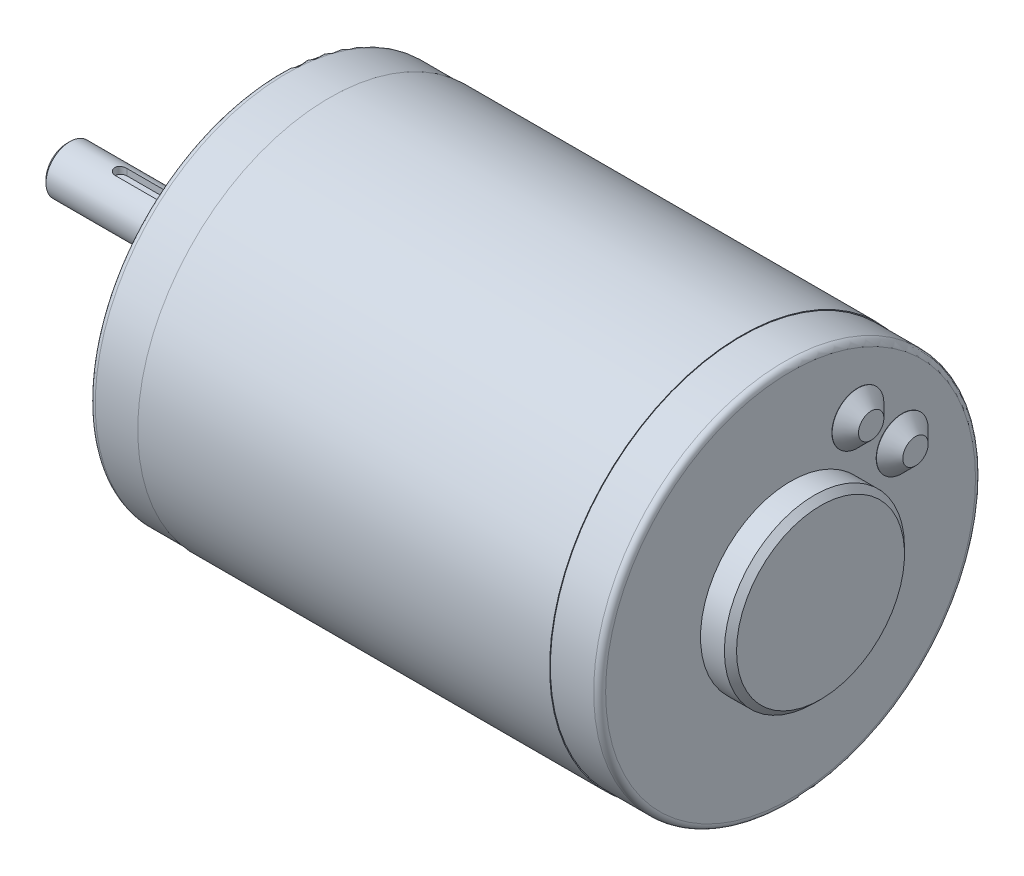
ISO-10303-21;
HEADER;
FILE_DESCRIPTION(('STEP AP214'),'2;1');
FILE_NAME('part.step','',(''),(''),'','','');
FILE_SCHEMA(('AUTOMOTIVE_DESIGN { 1 0 10303 214 1 1 1 1 }'));
ENDSEC;
DATA;
#1=APPLICATION_CONTEXT('core data for automotive mechanical design processes');
#2=APPLICATION_PROTOCOL_DEFINITION('international standard','automotive_design',2000,#1);
#3=PRODUCT_CONTEXT('',#1,'mechanical');
#4=PRODUCT('Part','Part','',(#3));
#5=PRODUCT_RELATED_PRODUCT_CATEGORY('part','',(#4));
#6=PRODUCT_DEFINITION_FORMATION('','',#4);
#7=PRODUCT_DEFINITION_CONTEXT('part definition',#1,'design');
#8=PRODUCT_DEFINITION('design','',#6,#7);
#9=PRODUCT_DEFINITION_SHAPE('','',#8);
#10=(LENGTH_UNIT() NAMED_UNIT(*) SI_UNIT(.MILLI.,.METRE.));
#11=(NAMED_UNIT(*) PLANE_ANGLE_UNIT() SI_UNIT($,.RADIAN.));
#12=(NAMED_UNIT(*) SI_UNIT($,.STERADIAN.) SOLID_ANGLE_UNIT());
#13=UNCERTAINTY_MEASURE_WITH_UNIT(LENGTH_MEASURE(1.E-05),#10,'distance_accuracy_value','');
#14=(GEOMETRIC_REPRESENTATION_CONTEXT(3) GLOBAL_UNCERTAINTY_ASSIGNED_CONTEXT((#13)) GLOBAL_UNIT_ASSIGNED_CONTEXT((#10,
#11,#12)) REPRESENTATION_CONTEXT('',''));
#15=CARTESIAN_POINT('',(0.,0.,0.));
#16=DIRECTION('',(0.,0.,1.));
#17=DIRECTION('',(1.,0.,0.));
#18=AXIS2_PLACEMENT_3D('',#15,#16,#17);
#19=CARTESIAN_POINT('',(-35.6,0.,0.));
#20=DIRECTION('',(-1.,0.,0.));
#21=DIRECTION('',(0.,0.,1.));
#22=AXIS2_PLACEMENT_3D('',#19,#20,#21);
#23=PLANE('',#22);
#24=CARTESIAN_POINT('',(-35.6000000000449,0.,0.));
#25=DIRECTION('',(1.,0.,0.));
#26=DIRECTION('',(0.,0.,-1.));
#27=AXIS2_PLACEMENT_3D('',#24,#25,#26);
#28=CIRCLE('',#27,3.49999999997408);
#29=CARTESIAN_POINT('',(-35.6000000000449,0.,-3.49999999997408));
#30=VERTEX_POINT('',#29);
#31=EDGE_CURVE('E20',#30,#30,#28,.T.);
#32=ORIENTED_EDGE('',*,*,#31,.F.);
#33=EDGE_LOOP('',(#32));
#34=FACE_BOUND('',#33,.T.);
#35=ADVANCED_FACE('F17',(#34),#23,.T.);
#36=CARTESIAN_POINT('',(-27.6,2.79999999999999,-1.));
#37=DIRECTION('',(0.,-1.,0.));
#38=DIRECTION('',(0.,0.,-1.));
#39=AXIS2_PLACEMENT_3D('',#36,#37,#38);
#40=PLANE('',#39);
#41=CARTESIAN_POINT('',(-7.1,2.79999999999999,0.));
#42=DIRECTION('',(0.,1.,0.));
#43=DIRECTION('',(0.,0.,1.));
#44=AXIS2_PLACEMENT_3D('',#41,#42,#43);
#45=CIRCLE('',#44,1.);
#46=CARTESIAN_POINT('',(-7.1,2.79999999999999,1.));
#47=VERTEX_POINT('',#46);
#48=CARTESIAN_POINT('',(-7.1,2.79999999999999,-1.));
#49=VERTEX_POINT('',#48);
#50=EDGE_CURVE('E79',#47,#49,#45,.T.);
#51=ORIENTED_EDGE('',*,*,#50,.T.);
#52=DIRECTION('',(1.,0.,0.));
#53=VECTOR('',#52,1.);
#54=CARTESIAN_POINT('',(-27.6,2.79999999999999,-1.));
#55=LINE('',#54,#53);
#56=CARTESIAN_POINT('',(-26.6,2.79999999999999,-1.));
#57=VERTEX_POINT('',#56);
#58=EDGE_CURVE('E73',#57,#49,#55,.T.);
#59=ORIENTED_EDGE('',*,*,#58,.F.);
#60=CARTESIAN_POINT('',(-26.6,2.79999999999999,0.));
#61=DIRECTION('',(0.,-1.,0.));
#62=DIRECTION('',(0.,0.,-1.));
#63=AXIS2_PLACEMENT_3D('',#60,#61,#62);
#64=CIRCLE('',#63,1.);
#65=CARTESIAN_POINT('',(-26.6,2.79999999999999,1.));
#66=VERTEX_POINT('',#65);
#67=EDGE_CURVE('E76',#57,#66,#64,.F.);
#68=ORIENTED_EDGE('',*,*,#67,.T.);
#69=DIRECTION('',(1.,0.,0.));
#70=VECTOR('',#69,1.);
#71=CARTESIAN_POINT('',(-27.6,2.79999999999999,1.));
#72=LINE('',#71,#70);
#73=EDGE_CURVE('E101',#66,#47,#72,.T.);
#74=ORIENTED_EDGE('',*,*,#73,.T.);
#75=EDGE_LOOP('',(#51,#59,#68,#74));
#76=FACE_BOUND('',#75,.T.);
#77=ADVANCED_FACE('F75',(#76),#40,.F.);
#78=CARTESIAN_POINT('',(-35.1000000000568,0.,0.));
#79=DIRECTION('',(1.,0.,0.));
#80=DIRECTION('',(0.,0.,-1.));
#81=AXIS2_PLACEMENT_3D('',#78,#79,#80);
#82=CONICAL_SURFACE('',#81,4.0000000000191,0.785398163454292);
#83=ORIENTED_EDGE('',*,*,#31,.T.);
#84=EDGE_LOOP('',(#83));
#85=FACE_BOUND('',#84,.T.);
#86=CARTESIAN_POINT('',(-35.1,0.,0.));
#87=DIRECTION('',(1.,0.,0.));
#88=DIRECTION('',(0.,0.,-1.));
#89=AXIS2_PLACEMENT_3D('',#86,#87,#88);
#90=CIRCLE('',#89,4.);
#91=CARTESIAN_POINT('',(-35.1,0.,-4.));
#92=VERTEX_POINT('',#91);
#93=EDGE_CURVE('E339',#92,#92,#90,.T.);
#94=ORIENTED_EDGE('',*,*,#93,.F.);
#95=EDGE_LOOP('',(#94));
#96=FACE_BOUND('',#95,.T.);
#97=ADVANCED_FACE('F572',(#85,#96),#82,.T.);
#98=CARTESIAN_POINT('',(-26.6,3.87298334620741,0.));
#99=DIRECTION('',(0.,-1.,0.));
#100=DIRECTION('',(0.,0.,-1.));
#101=AXIS2_PLACEMENT_3D('',#98,#99,#100);
#102=CYLINDRICAL_SURFACE('',#101,1.);
#103=CARTESIAN_POINT('',(-26.6,3.87298334620742,1.));
#104=CARTESIAN_POINT('',(-26.6276629851065,3.87298148580177,1.00000033749611));
#105=CARTESIAN_POINT('',(-26.6553122630182,3.87328009949471,0.998851407375366));
#106=CARTESIAN_POINT('',(-26.7104040353036,3.87445904774559,0.994271295395754));
#107=CARTESIAN_POINT('',(-26.7378465636871,3.87533928441687,0.990840497572679));
#108=CARTESIAN_POINT('',(-26.8194531732088,3.87881710972054,0.977175239382527));
#109=CARTESIAN_POINT('',(-26.8730564684822,3.88225203148809,0.963567695172493));
#110=CARTESIAN_POINT('',(-26.977124673782,3.89095422588003,0.927798076247996));
#111=CARTESIAN_POINT('',(-27.0275898782129,3.8962213263093,0.905636805423835));
#112=CARTESIAN_POINT('',(-27.1241114486473,3.90799134471939,0.853415378025864));
#113=CARTESIAN_POINT('',(-27.170166627891,3.91449459395647,0.823353103356932));
#114=CARTESIAN_POINT('',(-27.2575438819061,3.92816262398025,0.755484471828068));
#115=CARTESIAN_POINT('',(-27.2987548862455,3.93533791028916,0.717537268783975));
#116=CARTESIAN_POINT('',(-27.3743020894827,3.94945104396194,0.635275780516229));
#117=CARTESIAN_POINT('',(-27.4086371894679,3.95638885322537,0.59096047947883));
#118=CARTESIAN_POINT('',(-27.4699110016186,3.96936182283248,0.496456899401689));
#119=CARTESIAN_POINT('',(-27.496739895984,3.9753830468173,0.446195340334472));
#120=CARTESIAN_POINT('',(-27.5415247341967,3.98572346250589,0.341702590842918));
#121=CARTESIAN_POINT('',(-27.5594824242998,3.99004298914701,0.28747218408301));
#122=CARTESIAN_POINT('',(-27.5856589927774,3.99641900005128,0.17774410852516));
#123=CARTESIAN_POINT('',(-27.5940676724228,3.99851952901301,0.122294322002858));
#124=CARTESIAN_POINT('',(-27.6015033715433,4.00037438150816,0.0107327756816791));
#125=CARTESIAN_POINT('',(-27.6005315701923,4.00012899993445,-0.0453789000287062));
#126=CARTESIAN_POINT('',(-27.5893700363146,3.99735237365736,-0.155352492972097));
#127=CARTESIAN_POINT('',(-27.5793853834005,3.99487198677361,-0.209236701739855));
#128=CARTESIAN_POINT('',(-27.5508113208173,3.98796330636496,-0.31453871108434));
#129=CARTESIAN_POINT('',(-27.5322215304314,3.98353492665556,-0.365956402423988));
#130=CARTESIAN_POINT('',(-27.4867987193294,3.97314997761798,-0.465407286024539));
#131=CARTESIAN_POINT('',(-27.4598926057672,3.96717993827555,-0.513405629602249));
#132=CARTESIAN_POINT('',(-27.3986568701665,3.95435945541919,-0.604276631230015));
#133=CARTESIAN_POINT('',(-27.3643261297468,3.94750887933198,-0.64714851556229));
#134=CARTESIAN_POINT('',(-27.2881210879187,3.93345566022866,-0.727769389708492));
#135=CARTESIAN_POINT('',(-27.2460683634602,3.92624850477686,-0.765349103054128));
#136=CARTESIAN_POINT('',(-27.1561701330723,3.91246168284006,-0.832969575186237));
#137=CARTESIAN_POINT('',(-27.1083230467164,3.90588218842993,-0.863008270245062));
#138=CARTESIAN_POINT('',(-27.0078544021762,3.89407813586325,-0.914804709285961));
#139=CARTESIAN_POINT('',(-26.9552085351039,3.88886106009137,-0.936517017887269));
#140=CARTESIAN_POINT('',(-26.8468830715817,3.88047058807055,-0.970702351849828));
#141=CARTESIAN_POINT('',(-26.7912081448502,3.87729413761435,-0.983189189212131));
#142=CARTESIAN_POINT('',(-26.7125426192411,3.87455290681524,-0.993904635150938));
#143=CARTESIAN_POINT('',(-26.6900802967868,3.8739652311086,-0.996190790966708));
#144=CARTESIAN_POINT('',(-26.6450822100907,3.87318062488975,-0.999236757697393));
#145=CARTESIAN_POINT('',(-26.6225466240447,3.87298306219461,-0.999999038096045));
#146=CARTESIAN_POINT('',(-26.6,3.87298334620742,-1.));
#147=B_SPLINE_CURVE_WITH_KNOTS('',3,(#103,#104,#105,#106,#107,#108,#109,#110,#111,#112,#113,
#114,#115,#116,#117,#118,#119,#120,#121,#122,#123,#124,#125,#126,#127,#128,#129,#130,#131,#132,
#133,#134,#135,#136,#137,#138,#139,#140,#141,#142,#143,#144,#145,#146),.UNSPECIFIED.,.F.,.F.,(4,
2,2,2,2,2,2,2,2,2,2,2,2,2,2,2,2,2,2,2,2,4),(0.,0.0829365303397693,0.16585910608465,
0.331229963080318,0.496585282091499,0.661984974726751,0.830641897427976,0.999325753539196,
1.17036187098235,1.34136430732424,1.50890481515325,1.67642426256639,1.84022545479276,
2.00403389475838,2.16932509450377,2.33464120964329,2.50441429534542,2.67423379180967,
2.84496720161068,3.01544447539986,3.08315848722648,3.15076267731671),.UNSPECIFIED.);
#148=CARTESIAN_POINT('',(-26.6,3.87298334620742,1.));
#149=VERTEX_POINT('',#148);
#150=CARTESIAN_POINT('',(-26.6,3.87298334620742,-1.));
#151=VERTEX_POINT('',#150);
#152=EDGE_CURVE('E158',#149,#151,#147,.T.);
#153=ORIENTED_EDGE('',*,*,#152,.F.);
#154=DIRECTION('',(0.,1.,0.));
#155=VECTOR('',#154,1.);
#156=CARTESIAN_POINT('',(-26.6,2.79999999999999,1.));
#157=LINE('',#156,#155);
#158=EDGE_CURVE('E89',#149,#66,#157,.F.);
#159=ORIENTED_EDGE('',*,*,#158,.T.);
#160=ORIENTED_EDGE('',*,*,#67,.F.);
#161=DIRECTION('',(0.,1.,0.));
#162=VECTOR('',#161,1.);
#163=CARTESIAN_POINT('',(-26.6,2.79999999999999,-1.));
#164=LINE('',#163,#162);
#165=EDGE_CURVE('E83',#151,#57,#164,.F.);
#166=ORIENTED_EDGE('',*,*,#165,.F.);
#167=EDGE_LOOP('',(#153,#159,#160,#166));
#168=FACE_BOUND('',#167,.T.);
#169=ADVANCED_FACE('F86',(#168),#102,.F.);
#170=CARTESIAN_POINT('',(-27.6,2.79999999999999,-1.));
#171=DIRECTION('',(0.,0.,1.));
#172=DIRECTION('',(1.,0.,0.));
#173=AXIS2_PLACEMENT_3D('',#170,#171,#172);
#174=PLANE('',#173);
#175=DIRECTION('',(1.,0.,0.));
#176=VECTOR('',#175,1.);
#177=CARTESIAN_POINT('',(0.,3.87298334620742,-1.));
#178=LINE('',#177,#176);
#179=CARTESIAN_POINT('',(-7.1,3.87298334620742,-1.));
#180=VERTEX_POINT('',#179);
#181=EDGE_CURVE('E93',#151,#180,#178,.T.);
#182=ORIENTED_EDGE('',*,*,#181,.F.);
#183=ORIENTED_EDGE('',*,*,#165,.T.);
#184=ORIENTED_EDGE('',*,*,#58,.T.);
#185=DIRECTION('',(0.,1.,0.));
#186=VECTOR('',#185,1.);
#187=CARTESIAN_POINT('',(-7.1,2.79999999999999,-1.));
#188=LINE('',#187,#186);
#189=EDGE_CURVE('E96',#49,#180,#188,.T.);
#190=ORIENTED_EDGE('',*,*,#189,.T.);
#191=EDGE_LOOP('',(#182,#183,#184,#190));
#192=FACE_BOUND('',#191,.T.);
#193=ADVANCED_FACE('F91',(#192),#174,.T.);
#194=CARTESIAN_POINT('',(-7.1,2.79999999999999,0.));
#195=DIRECTION('',(0.,1.,0.));
#196=DIRECTION('',(0.,0.,1.));
#197=AXIS2_PLACEMENT_3D('',#194,#195,#196);
#198=CYLINDRICAL_SURFACE('',#197,1.);
#199=ORIENTED_EDGE('',*,*,#50,.F.);
#200=DIRECTION('',(0.,1.,0.));
#201=VECTOR('',#200,1.);
#202=CARTESIAN_POINT('',(-7.1,2.79999999999999,1.));
#203=LINE('',#202,#201);
#204=CARTESIAN_POINT('',(-7.1,3.87298334620742,1.));
#205=VERTEX_POINT('',#204);
#206=EDGE_CURVE('E102',#47,#205,#203,.T.);
#207=ORIENTED_EDGE('',*,*,#206,.T.);
#208=CARTESIAN_POINT('',(-7.1,3.87298334620742,-1.));
#209=CARTESIAN_POINT('',(-7.07233701489346,3.87298148580177,-1.00000033749611));
#210=CARTESIAN_POINT('',(-7.04468773698177,3.87328009949471,-0.998851407375366));
#211=CARTESIAN_POINT('',(-6.98959596469644,3.87445904774559,-0.994271295395754));
#212=CARTESIAN_POINT('',(-6.96215343631291,3.87533928441687,-0.990840497572679));
#213=CARTESIAN_POINT('',(-6.88054682679116,3.87881710972054,-0.977175239382526));
#214=CARTESIAN_POINT('',(-6.82694353151779,3.88225203148809,-0.963567695172493));
#215=CARTESIAN_POINT('',(-6.72287532621803,3.89095422588003,-0.927798076247996));
#216=CARTESIAN_POINT('',(-6.67241012178714,3.8962213263093,-0.905636805423835));
#217=CARTESIAN_POINT('',(-6.57588855135267,3.90799134471939,-0.853415378025865));
#218=CARTESIAN_POINT('',(-6.52983337210903,3.91449459395647,-0.823353103356932));
#219=CARTESIAN_POINT('',(-6.4424561180939,3.92816262398025,-0.755484471828068));
#220=CARTESIAN_POINT('',(-6.40124511375448,3.93533791028916,-0.717537268783975));
#221=CARTESIAN_POINT('',(-6.32569791051729,3.94945104396193,-0.63527578051623));
#222=CARTESIAN_POINT('',(-6.29136281053206,3.95638885322537,-0.590960479478831));
#223=CARTESIAN_POINT('',(-6.23008899838135,3.96936182283248,-0.49645689940169));
#224=CARTESIAN_POINT('',(-6.20326010401602,3.9753830468173,-0.446195340334473));
#225=CARTESIAN_POINT('',(-6.15847526580329,3.98572346250589,-0.341702590842919));
#226=CARTESIAN_POINT('',(-6.14051757570017,3.99004298914701,-0.287472184083009));
#227=CARTESIAN_POINT('',(-6.11434100722257,3.99641900005128,-0.17774410852516));
#228=CARTESIAN_POINT('',(-6.10593232757718,3.99851952901301,-0.122294322002857));
#229=CARTESIAN_POINT('',(-6.0984966284567,4.00037438150816,-0.0107327756816793));
#230=CARTESIAN_POINT('',(-6.09946842980766,4.00012899993445,0.0453789000287059));
#231=CARTESIAN_POINT('',(-6.11062996368545,3.99735237365736,0.155352492972096));
#232=CARTESIAN_POINT('',(-6.12061461659948,3.99487198677361,0.209236701739855));
#233=CARTESIAN_POINT('',(-6.14918867918275,3.98796330636496,0.31453871108434));
#234=CARTESIAN_POINT('',(-6.16777846956858,3.98353492665556,0.365956402423988));
#235=CARTESIAN_POINT('',(-6.21320128067065,3.97314997761798,0.465407286024539));
#236=CARTESIAN_POINT('',(-6.24010739423284,3.96717993827555,0.513405629602249));
#237=CARTESIAN_POINT('',(-6.30134312983346,3.95435945541919,0.604276631230014));
#238=CARTESIAN_POINT('',(-6.33567387025322,3.94750887933198,0.647148515562289));
#239=CARTESIAN_POINT('',(-6.41187891208131,3.93345566022866,0.72776938970849));
#240=CARTESIAN_POINT('',(-6.45393163653981,3.92624850477686,0.765349103054127));
#241=CARTESIAN_POINT('',(-6.54382986692773,3.91246168284006,0.832969575186237));
#242=CARTESIAN_POINT('',(-6.59167695328356,3.90588218842993,0.863008270245062));
#243=CARTESIAN_POINT('',(-6.69214559782376,3.89407813586325,0.914804709285961));
#244=CARTESIAN_POINT('',(-6.74479146489608,3.88886106009137,0.936517017887269));
#245=CARTESIAN_POINT('',(-6.85311692841828,3.88047058807055,0.970702351849828));
#246=CARTESIAN_POINT('',(-6.90879185514984,3.87729413761435,0.983189189212131));
#247=CARTESIAN_POINT('',(-6.9874573807589,3.87455290681524,0.993904635150937));
#248=CARTESIAN_POINT('',(-7.00991970321318,3.8739652311086,0.996190790966708));
#249=CARTESIAN_POINT('',(-7.05491778990932,3.87318062488975,0.999236757697393));
#250=CARTESIAN_POINT('',(-7.07745337595529,3.87298306219461,0.999999038096045));
#251=CARTESIAN_POINT('',(-7.1,3.87298334620742,1.));
#252=B_SPLINE_CURVE_WITH_KNOTS('',3,(#208,#209,#210,#211,#212,#213,#214,#215,#216,#217,#218,
#219,#220,#221,#222,#223,#224,#225,#226,#227,#228,#229,#230,#231,#232,#233,#234,#235,#236,#237,
#238,#239,#240,#241,#242,#243,#244,#245,#246,#247,#248,#249,#250,#251),.UNSPECIFIED.,.F.,.F.,(4,
2,2,2,2,2,2,2,2,2,2,2,2,2,2,2,2,2,2,2,2,4),(0.,0.0829365303397684,0.16585910608465,
0.331229963080317,0.4965852820915,0.661984974726749,0.830641897427975,0.999325753539193,
1.17036187098235,1.34136430732424,1.50890481515325,1.67642426256639,1.84022545479275,
2.00403389475838,2.16932509450376,2.33464120964329,2.50441429534542,2.67423379180967,
2.84496720161067,3.01544447539986,3.08315848722648,3.15076267731671),.UNSPECIFIED.);
#253=EDGE_CURVE('E150',#180,#205,#252,.T.);
#254=ORIENTED_EDGE('',*,*,#253,.F.);
#255=ORIENTED_EDGE('',*,*,#189,.F.);
#256=EDGE_LOOP('',(#199,#207,#254,#255));
#257=FACE_BOUND('',#256,.T.);
#258=ADVANCED_FACE('F163',(#257),#198,.F.);
#259=CARTESIAN_POINT('',(-27.6,2.79999999999999,1.));
#260=DIRECTION('',(0.,0.,1.));
#261=DIRECTION('',(1.,0.,0.));
#262=AXIS2_PLACEMENT_3D('',#259,#260,#261);
#263=PLANE('',#262);
#264=ORIENTED_EDGE('',*,*,#206,.F.);
#265=ORIENTED_EDGE('',*,*,#73,.F.);
#266=ORIENTED_EDGE('',*,*,#158,.F.);
#267=DIRECTION('',(1.,0.,0.));
#268=VECTOR('',#267,1.);
#269=CARTESIAN_POINT('',(0.,3.87298334620742,1.));
#270=LINE('',#269,#268);
#271=EDGE_CURVE('E149',#205,#149,#270,.F.);
#272=ORIENTED_EDGE('',*,*,#271,.F.);
#273=EDGE_LOOP('',(#264,#265,#266,#272));
#274=FACE_BOUND('',#273,.T.);
#275=ADVANCED_FACE('F172',(#274),#263,.F.);
#276=CARTESIAN_POINT('',(0.,0.,0.));
#277=DIRECTION('',(1.,0.,0.));
#278=DIRECTION('',(0.,0.,-1.));
#279=AXIS2_PLACEMENT_3D('',#276,#277,#278);
#280=CYLINDRICAL_SURFACE('',#279,4.);
#281=ORIENTED_EDGE('',*,*,#93,.T.);
#282=EDGE_LOOP('',(#281));
#283=FACE_BOUND('',#282,.T.);
#284=ORIENTED_EDGE('',*,*,#253,.T.);
#285=ORIENTED_EDGE('',*,*,#271,.T.);
#286=ORIENTED_EDGE('',*,*,#152,.T.);
#287=ORIENTED_EDGE('',*,*,#181,.T.);
#288=EDGE_LOOP('',(#284,#285,#286,#287));
#289=FACE_BOUND('',#288,.T.);
#290=CARTESIAN_POINT('',(-4.,0.,0.));
#291=DIRECTION('',(1.,0.,0.));
#292=DIRECTION('',(0.,0.,-1.));
#293=AXIS2_PLACEMENT_3D('',#290,#291,#292);
#294=CIRCLE('',#293,4.);
#295=CARTESIAN_POINT('',(-4.,0.,-4.));
#296=VERTEX_POINT('',#295);
#297=EDGE_CURVE('E146',#296,#296,#294,.T.);
#298=ORIENTED_EDGE('',*,*,#297,.F.);
#299=EDGE_LOOP('',(#298));
#300=FACE_BOUND('',#299,.T.);
#301=ADVANCED_FACE('F167',(#283,#289,#300),#280,.T.);
#302=CARTESIAN_POINT('',(90.216,15.0368,0.));
#303=DIRECTION('',(1.,0.,0.));
#304=DIRECTION('',(0.,0.,-1.));
#305=AXIS2_PLACEMENT_3D('',#302,#303,#304);
#306=PLANE('',#305);
#307=CARTESIAN_POINT('',(90.216,0.,0.));
#308=DIRECTION('',(-1.,0.,0.));
#309=DIRECTION('',(0.,0.,1.));
#310=AXIS2_PLACEMENT_3D('',#307,#308,#309);
#311=CIRCLE('',#310,14.0208);
#312=CARTESIAN_POINT('',(90.216,0.,14.0208));
#313=VERTEX_POINT('',#312);
#314=EDGE_CURVE('E143',#313,#313,#311,.T.);
#315=ORIENTED_EDGE('',*,*,#314,.F.);
#316=EDGE_LOOP('',(#315));
#317=FACE_BOUND('',#316,.T.);
#318=ADVANCED_FACE('F171',(#317),#306,.T.);
#319=CARTESIAN_POINT('',(87.4639,11.2073596390943,-18.6070906828553));
#320=DIRECTION('',(1.,0.,0.));
#321=DIRECTION('',(0.,0.,-1.));
#322=AXIS2_PLACEMENT_3D('',#319,#320,#321);
#323=PLANE('',#322);
#324=CARTESIAN_POINT('',(87.4638999999888,11.2073596390943,-18.6070906828553));
#325=DIRECTION('',(-1.,0.,0.));
#326=DIRECTION('',(0.,0.,1.));
#327=AXIS2_PLACEMENT_3D('',#324,#325,#326);
#328=CIRCLE('',#327,2.1180000000021);
#329=CARTESIAN_POINT('',(87.4638999999888,11.2073596390943,-16.4890906828532));
#330=VERTEX_POINT('',#329);
#331=EDGE_CURVE('E140',#330,#330,#328,.T.);
#332=ORIENTED_EDGE('',*,*,#331,.F.);
#333=EDGE_LOOP('',(#332));
#334=FACE_BOUND('',#333,.T.);
#335=ADVANCED_FACE('F410',(#334),#323,.T.);
#336=CARTESIAN_POINT('',(87.4639,18.6070906828553,-11.2073596390943));
#337=DIRECTION('',(1.,0.,0.));
#338=DIRECTION('',(0.,0.,-1.));
#339=AXIS2_PLACEMENT_3D('',#336,#337,#338);
#340=PLANE('',#339);
#341=CARTESIAN_POINT('',(87.4638999998751,18.6070906828553,-11.2073596390943));
#342=DIRECTION('',(-1.,0.,0.));
#343=DIRECTION('',(0.,0.,1.));
#344=AXIS2_PLACEMENT_3D('',#341,#342,#343);
#345=CIRCLE('',#344,2.11799999997458);
#346=CARTESIAN_POINT('',(87.4638999998751,18.6070906828553,-9.08935963911972));
#347=VERTEX_POINT('',#346);
#348=EDGE_CURVE('E137',#347,#347,#345,.T.);
#349=ORIENTED_EDGE('',*,*,#348,.F.);
#350=EDGE_LOOP('',(#349));
#351=FACE_BOUND('',#350,.T.);
#352=ADVANCED_FACE('F354',(#351),#340,.T.);
#353=CARTESIAN_POINT('',(-4.,4.,0.));
#354=DIRECTION('',(-1.,0.,0.));
#355=DIRECTION('',(0.,0.,1.));
#356=AXIS2_PLACEMENT_3D('',#353,#354,#355);
#357=PLANE('',#356);
#358=ORIENTED_EDGE('',*,*,#297,.T.);
#359=EDGE_LOOP('',(#358));
#360=FACE_BOUND('',#359,.T.);
#361=CARTESIAN_POINT('',(-4.,0.,0.));
#362=DIRECTION('',(1.,0.,0.));
#363=DIRECTION('',(0.,0.,-1.));
#364=AXIS2_PLACEMENT_3D('',#361,#362,#363);
#365=CIRCLE('',#364,8.509);
#366=CARTESIAN_POINT('',(-4.,0.,-8.509));
#367=VERTEX_POINT('',#366);
#368=EDGE_CURVE('E133',#367,#367,#365,.T.);
#369=ORIENTED_EDGE('',*,*,#368,.F.);
#370=EDGE_LOOP('',(#369));
#371=FACE_BOUND('',#370,.T.);
#372=ADVANCED_FACE('F350',(#360,#371),#357,.T.);
#373=CARTESIAN_POINT('',(89.2,0.,0.));
#374=DIRECTION('',(-1.,0.,0.));
#375=DIRECTION('',(0.,0.,1.));
#376=AXIS2_PLACEMENT_3D('',#373,#374,#375);
#377=CONICAL_SURFACE('',#376,15.0368,0.78539816339745);
#378=ORIENTED_EDGE('',*,*,#314,.T.);
#379=EDGE_LOOP('',(#378));
#380=FACE_BOUND('',#379,.T.);
#381=CARTESIAN_POINT('',(89.2,0.,0.));
#382=DIRECTION('',(1.,0.,0.));
#383=DIRECTION('',(0.,0.,-1.));
#384=AXIS2_PLACEMENT_3D('',#381,#382,#383);
#385=CIRCLE('',#384,15.0368);
#386=CARTESIAN_POINT('',(89.2,0.,-15.0368));
#387=VERTEX_POINT('',#386);
#388=EDGE_CURVE('E136',#387,#387,#385,.F.);
#389=ORIENTED_EDGE('',*,*,#388,.F.);
#390=EDGE_LOOP('',(#389));
#391=FACE_BOUND('',#390,.T.);
#392=ADVANCED_FACE('F353',(#380,#391),#377,.T.);
#393=CARTESIAN_POINT('',(85.2639000000863,11.2073596390943,-18.6070906828553));
#394=DIRECTION('',(-1.,0.,0.));
#395=DIRECTION('',(0.,0.,1.));
#396=AXIS2_PLACEMENT_3D('',#393,#394,#395);
#397=CONICAL_SURFACE('',#396,4.3179999999046,0.785398163397448);
#398=ORIENTED_EDGE('',*,*,#331,.T.);
#399=EDGE_LOOP('',(#398));
#400=FACE_BOUND('',#399,.T.);
#401=CARTESIAN_POINT('',(85.2639,11.2073596390943,-18.6070906828553));
#402=DIRECTION('',(-1.,0.,0.));
#403=DIRECTION('',(0.,0.,1.));
#404=AXIS2_PLACEMENT_3D('',#401,#402,#403);
#405=CIRCLE('',#404,4.318);
#406=CARTESIAN_POINT('',(85.2639,11.2073596390943,-14.2890906828553));
#407=VERTEX_POINT('',#406);
#408=EDGE_CURVE('E325',#407,#407,#405,.T.);
#409=ORIENTED_EDGE('',*,*,#408,.F.);
#410=EDGE_LOOP('',(#409));
#411=FACE_BOUND('',#410,.T.);
#412=ADVANCED_FACE('F401',(#400,#411),#397,.T.);
#413=CARTESIAN_POINT('',(85.2639000000295,18.6070906828553,-11.2073596390943));
#414=DIRECTION('',(-1.,0.,0.));
#415=DIRECTION('',(0.,0.,1.));
#416=AXIS2_PLACEMENT_3D('',#413,#414,#415);
#417=CONICAL_SURFACE('',#416,4.31799999987708,0.785398163410367);
#418=ORIENTED_EDGE('',*,*,#348,.T.);
#419=EDGE_LOOP('',(#418));
#420=FACE_BOUND('',#419,.T.);
#421=CARTESIAN_POINT('',(85.2639,18.6070906828553,-11.2073596390943));
#422=DIRECTION('',(-1.,0.,0.));
#423=DIRECTION('',(0.,0.,1.));
#424=AXIS2_PLACEMENT_3D('',#421,#422,#423);
#425=CIRCLE('',#424,4.318);
#426=CARTESIAN_POINT('',(85.2639,18.6070906828553,-6.8893596390943));
#427=VERTEX_POINT('',#426);
#428=EDGE_CURVE('E320',#427,#427,#425,.T.);
#429=ORIENTED_EDGE('',*,*,#428,.F.);
#430=EDGE_LOOP('',(#429));
#431=FACE_BOUND('',#430,.T.);
#432=ADVANCED_FACE('F362',(#420,#431),#417,.T.);
#433=CARTESIAN_POINT('',(-2.984,0.,0.));
#434=DIRECTION('',(1.,0.,0.));
#435=DIRECTION('',(0.,0.,-1.));
#436=AXIS2_PLACEMENT_3D('',#433,#434,#435);
#437=CONICAL_SURFACE('',#436,9.525,0.78539816339745);
#438=ORIENTED_EDGE('',*,*,#368,.T.);
#439=EDGE_LOOP('',(#438));
#440=FACE_BOUND('',#439,.T.);
#441=CARTESIAN_POINT('',(-2.984,0.,0.));
#442=DIRECTION('',(1.,0.,0.));
#443=DIRECTION('',(0.,0.,-1.));
#444=AXIS2_PLACEMENT_3D('',#441,#442,#443);
#445=CIRCLE('',#444,9.525);
#446=CARTESIAN_POINT('',(-2.984,0.,-9.525));
#447=VERTEX_POINT('',#446);
#448=EDGE_CURVE('E317',#447,#447,#445,.T.);
#449=ORIENTED_EDGE('',*,*,#448,.F.);
#450=EDGE_LOOP('',(#449));
#451=FACE_BOUND('',#450,.T.);
#452=ADVANCED_FACE('F358',(#440,#451),#437,.T.);
#453=CARTESIAN_POINT('',(13.6143999999376,25.4,0.));
#454=DIRECTION('',(-1.,0.,0.));
#455=DIRECTION('',(0.,0.,1.));
#456=AXIS2_PLACEMENT_3D('',#453,#454,#455);
#457=CONICAL_SURFACE('',#456,2.01930000002903,1.02974425867198);
#458=CARTESIAN_POINT('',(13.6144,25.4,0.));
#459=DIRECTION('',(-1.,0.,0.));
#460=DIRECTION('',(0.,0.,1.));
#461=AXIS2_PLACEMENT_3D('',#458,#459,#460);
#462=CIRCLE('',#461,2.0193);
#463=CARTESIAN_POINT('',(13.6144,25.4,2.0193));
#464=VERTEX_POINT('',#463);
#465=EDGE_CURVE('E314',#464,#464,#462,.T.);
#466=ORIENTED_EDGE('',*,*,#465,.T.);
#467=EDGE_LOOP('',(#466));
#468=FACE_BOUND('',#467,.T.);
#469=CARTESIAN_POINT('',(14.8277178479361,25.4,-5.6843418860808E-11));
#470=VERTEX_POINT('',#469);
#471=VERTEX_LOOP('',#470);
#472=FACE_BOUND('',#471,.T.);
#473=ADVANCED_FACE('F361',(#468,#472),#457,.F.);
#474=CARTESIAN_POINT('',(13.6143999999376,-25.4,0.));
#475=DIRECTION('',(-1.,0.,0.));
#476=DIRECTION('',(0.,0.,1.));
#477=AXIS2_PLACEMENT_3D('',#474,#475,#476);
#478=CONICAL_SURFACE('',#477,2.01930000002903,1.02974425867198);
#479=CARTESIAN_POINT('',(13.6144,-25.4,0.));
#480=DIRECTION('',(-1.,0.,0.));
#481=DIRECTION('',(0.,0.,1.));
#482=AXIS2_PLACEMENT_3D('',#479,#480,#481);
#483=CIRCLE('',#482,2.0193);
#484=CARTESIAN_POINT('',(13.6144,-25.4,2.0193));
#485=VERTEX_POINT('',#484);
#486=EDGE_CURVE('E132',#485,#485,#483,.T.);
#487=ORIENTED_EDGE('',*,*,#486,.T.);
#488=EDGE_LOOP('',(#487));
#489=FACE_BOUND('',#488,.T.);
#490=CARTESIAN_POINT('',(14.8277178479361,-25.4,-5.6843418860808E-11));
#491=VERTEX_POINT('',#490);
#492=VERTEX_LOOP('',#491);
#493=FACE_BOUND('',#492,.T.);
#494=ADVANCED_FACE('F391',(#489,#493),#478,.F.);
#495=CARTESIAN_POINT('',(0.,0.,0.));
#496=DIRECTION('',(1.,0.,0.));
#497=DIRECTION('',(0.,0.,-1.));
#498=AXIS2_PLACEMENT_3D('',#495,#496,#497);
#499=CYLINDRICAL_SURFACE('',#498,15.0368);
#500=CARTESIAN_POINT('',(85.216,0.,0.));
#501=DIRECTION('',(1.,0.,0.));
#502=DIRECTION('',(0.,0.,-1.));
#503=AXIS2_PLACEMENT_3D('',#500,#501,#502);
#504=CIRCLE('',#503,15.0368);
#505=CARTESIAN_POINT('',(85.216,0.,-15.0368));
#506=VERTEX_POINT('',#505);
#507=EDGE_CURVE('E129',#506,#506,#504,.F.);
#508=ORIENTED_EDGE('',*,*,#507,.F.);
#509=EDGE_LOOP('',(#508));
#510=FACE_BOUND('',#509,.T.);
#511=ORIENTED_EDGE('',*,*,#388,.T.);
#512=EDGE_LOOP('',(#511));
#513=FACE_BOUND('',#512,.T.);
#514=ADVANCED_FACE('F387',(#510,#513),#499,.T.);
#515=CARTESIAN_POINT('',(87.4639,11.2073596390943,-18.6070906828553));
#516=DIRECTION('',(-1.,0.,0.));
#517=DIRECTION('',(0.,0.,1.));
#518=AXIS2_PLACEMENT_3D('',#515,#516,#517);
#519=CYLINDRICAL_SURFACE('',#518,4.318);
#520=ORIENTED_EDGE('',*,*,#408,.T.);
#521=EDGE_LOOP('',(#520));
#522=FACE_BOUND('',#521,.T.);
#523=CARTESIAN_POINT('',(85.216,11.2073596390943,-18.6070906828553));
#524=DIRECTION('',(-1.,0.,0.));
#525=DIRECTION('',(0.,0.,1.));
#526=AXIS2_PLACEMENT_3D('',#523,#524,#525);
#527=CIRCLE('',#526,4.318);
#528=CARTESIAN_POINT('',(85.216,11.2073596390943,-14.2890906828553));
#529=VERTEX_POINT('',#528);
#530=EDGE_CURVE('E126',#529,#529,#527,.T.);
#531=ORIENTED_EDGE('',*,*,#530,.F.);
#532=EDGE_LOOP('',(#531));
#533=FACE_BOUND('',#532,.T.);
#534=ADVANCED_FACE('F381',(#522,#533),#519,.T.);
#535=CARTESIAN_POINT('',(87.4639,18.6070906828553,-11.2073596390943));
#536=DIRECTION('',(-1.,0.,0.));
#537=DIRECTION('',(0.,0.,1.));
#538=AXIS2_PLACEMENT_3D('',#535,#536,#537);
#539=CYLINDRICAL_SURFACE('',#538,4.318);
#540=ORIENTED_EDGE('',*,*,#428,.T.);
#541=EDGE_LOOP('',(#540));
#542=FACE_BOUND('',#541,.T.);
#543=CARTESIAN_POINT('',(85.216,18.6070906828553,-11.2073596390943));
#544=DIRECTION('',(-1.,0.,0.));
#545=DIRECTION('',(0.,0.,1.));
#546=AXIS2_PLACEMENT_3D('',#543,#544,#545);
#547=CIRCLE('',#546,4.318);
#548=CARTESIAN_POINT('',(85.216,18.6070906828553,-6.8893596390943));
#549=VERTEX_POINT('',#548);
#550=EDGE_CURVE('E123',#549,#549,#547,.T.);
#551=ORIENTED_EDGE('',*,*,#550,.F.);
#552=EDGE_LOOP('',(#551));
#553=FACE_BOUND('',#552,.T.);
#554=ADVANCED_FACE('F370',(#542,#553),#539,.T.);
#555=CARTESIAN_POINT('',(0.,0.,0.));
#556=DIRECTION('',(1.,0.,0.));
#557=DIRECTION('',(0.,0.,-1.));
#558=AXIS2_PLACEMENT_3D('',#555,#556,#557);
#559=CYLINDRICAL_SURFACE('',#558,9.525);
#560=ORIENTED_EDGE('',*,*,#448,.T.);
#561=EDGE_LOOP('',(#560));
#562=FACE_BOUND('',#561,.T.);
#563=CARTESIAN_POINT('',(0.,0.,0.));
#564=DIRECTION('',(1.,0.,0.));
#565=DIRECTION('',(0.,0.,-1.));
#566=AXIS2_PLACEMENT_3D('',#563,#564,#565);
#567=CIRCLE('',#566,9.525);
#568=CARTESIAN_POINT('',(0.,0.,-9.525));
#569=VERTEX_POINT('',#568);
#570=EDGE_CURVE('E120',#569,#569,#567,.T.);
#571=ORIENTED_EDGE('',*,*,#570,.F.);
#572=EDGE_LOOP('',(#571));
#573=FACE_BOUND('',#572,.T.);
#574=ADVANCED_FACE('F366',(#562,#573),#559,.T.);
#575=CARTESIAN_POINT('',(0.,25.4,0.));
#576=DIRECTION('',(-1.,0.,0.));
#577=DIRECTION('',(0.,0.,1.));
#578=AXIS2_PLACEMENT_3D('',#575,#576,#577);
#579=CYLINDRICAL_SURFACE('',#578,2.0193);
#580=CARTESIAN_POINT('',(0.,25.4,0.));
#581=DIRECTION('',(-1.,0.,0.));
#582=DIRECTION('',(0.,0.,1.));
#583=AXIS2_PLACEMENT_3D('',#580,#581,#582);
#584=CIRCLE('',#583,2.0193);
#585=CARTESIAN_POINT('',(0.,25.4,2.0193));
#586=VERTEX_POINT('',#585);
#587=EDGE_CURVE('E117',#586,#586,#584,.F.);
#588=ORIENTED_EDGE('',*,*,#587,.F.);
#589=EDGE_LOOP('',(#588));
#590=FACE_BOUND('',#589,.T.);
#591=ORIENTED_EDGE('',*,*,#465,.F.);
#592=EDGE_LOOP('',(#591));
#593=FACE_BOUND('',#592,.T.);
#594=ADVANCED_FACE('F369',(#590,#593),#579,.F.);
#595=CARTESIAN_POINT('',(0.,-25.4,0.));
#596=DIRECTION('',(-1.,0.,0.));
#597=DIRECTION('',(0.,0.,1.));
#598=AXIS2_PLACEMENT_3D('',#595,#596,#597);
#599=CYLINDRICAL_SURFACE('',#598,2.0193);
#600=CARTESIAN_POINT('',(0.,-25.4,0.));
#601=DIRECTION('',(-1.,0.,0.));
#602=DIRECTION('',(0.,0.,1.));
#603=AXIS2_PLACEMENT_3D('',#600,#601,#602);
#604=CIRCLE('',#603,2.0193);
#605=CARTESIAN_POINT('',(0.,-25.4,2.0193));
#606=VERTEX_POINT('',#605);
#607=EDGE_CURVE('E113',#606,#606,#604,.F.);
#608=ORIENTED_EDGE('',*,*,#607,.F.);
#609=EDGE_LOOP('',(#608));
#610=FACE_BOUND('',#609,.T.);
#611=ORIENTED_EDGE('',*,*,#486,.F.);
#612=EDGE_LOOP('',(#611));
#613=FACE_BOUND('',#612,.T.);
#614=ADVANCED_FACE('F378',(#610,#613),#599,.F.);
#615=CARTESIAN_POINT('',(85.216,31.877,0.));
#616=DIRECTION('',(1.,0.,0.));
#617=DIRECTION('',(0.,0.,-1.));
#618=AXIS2_PLACEMENT_3D('',#615,#616,#617);
#619=PLANE('',#618);
#620=ORIENTED_EDGE('',*,*,#550,.T.);
#621=EDGE_LOOP('',(#620));
#622=FACE_BOUND('',#621,.T.);
#623=ORIENTED_EDGE('',*,*,#530,.T.);
#624=EDGE_LOOP('',(#623));
#625=FACE_BOUND('',#624,.T.);
#626=ORIENTED_EDGE('',*,*,#507,.T.);
#627=EDGE_LOOP('',(#626));
#628=FACE_BOUND('',#627,.T.);
#629=CARTESIAN_POINT('',(85.216,0.,0.));
#630=DIRECTION('',(-1.,0.,0.));
#631=DIRECTION('',(0.,0.,1.));
#632=AXIS2_PLACEMENT_3D('',#629,#630,#631);
#633=CIRCLE('',#632,30.877);
#634=CARTESIAN_POINT('',(85.216,0.,30.877));
#635=VERTEX_POINT('',#634);
#636=CARTESIAN_POINT('',(85.216,0.,-30.877));
#637=VERTEX_POINT('',#636);
#638=EDGE_CURVE('E116',#635,#637,#633,.T.);
#639=ORIENTED_EDGE('',*,*,#638,.F.);
#640=CARTESIAN_POINT('',(85.216,0.,0.));
#641=DIRECTION('',(-1.,0.,0.));
#642=DIRECTION('',(0.,0.,-1.));
#643=AXIS2_PLACEMENT_3D('',#640,#641,#642);
#644=CIRCLE('',#643,30.877);
#645=EDGE_CURVE('E284',#637,#635,#644,.T.);
#646=ORIENTED_EDGE('',*,*,#645,.F.);
#647=EDGE_LOOP('',(#639,#646));
#648=FACE_BOUND('',#647,.T.);
#649=ADVANCED_FACE('F240',(#622,#625,#628,#648),#619,.T.);
#650=CARTESIAN_POINT('',(0.,9.525,0.));
#651=DIRECTION('',(-1.,0.,0.));
#652=DIRECTION('',(0.,0.,1.));
#653=AXIS2_PLACEMENT_3D('',#650,#651,#652);
#654=PLANE('',#653);
#655=ORIENTED_EDGE('',*,*,#607,.T.);
#656=EDGE_LOOP('',(#655));
#657=FACE_BOUND('',#656,.T.);
#658=ORIENTED_EDGE('',*,*,#587,.T.);
#659=EDGE_LOOP('',(#658));
#660=FACE_BOUND('',#659,.T.);
#661=ORIENTED_EDGE('',*,*,#570,.T.);
#662=EDGE_LOOP('',(#661));
#663=FACE_BOUND('',#662,.T.);
#664=CARTESIAN_POINT('',(0.,0.,0.));
#665=DIRECTION('',(1.,0.,0.));
#666=DIRECTION('',(0.,0.,-1.));
#667=AXIS2_PLACEMENT_3D('',#664,#665,#666);
#668=CIRCLE('',#667,30.877);
#669=CARTESIAN_POINT('',(0.,0.,-30.877));
#670=VERTEX_POINT('',#669);
#671=CARTESIAN_POINT('',(0.,0.,30.877));
#672=VERTEX_POINT('',#671);
#673=EDGE_CURVE('E227',#670,#672,#668,.T.);
#674=ORIENTED_EDGE('',*,*,#673,.F.);
#675=CARTESIAN_POINT('',(0.,0.,0.));
#676=DIRECTION('',(1.,0.,0.));
#677=DIRECTION('',(0.,0.,1.));
#678=AXIS2_PLACEMENT_3D('',#675,#676,#677);
#679=CIRCLE('',#678,30.877);
#680=EDGE_CURVE('E34',#672,#670,#679,.T.);
#681=ORIENTED_EDGE('',*,*,#680,.F.);
#682=EDGE_LOOP('',(#674,#681));
#683=FACE_BOUND('',#682,.T.);
#684=ADVANCED_FACE('F231',(#657,#660,#663,#683),#654,.T.);
#685=CARTESIAN_POINT('',(84.216,0.,0.));
#686=DIRECTION('',(1.,0.,0.));
#687=DIRECTION('',(0.,0.,-1.));
#688=AXIS2_PLACEMENT_3D('',#685,#686,#687);
#689=TOROIDAL_SURFACE('',#688,30.877,1.);
#690=CARTESIAN_POINT('',(84.216,0.,0.));
#691=DIRECTION('',(1.,0.,0.));
#692=DIRECTION('',(0.,0.,-1.));
#693=AXIS2_PLACEMENT_3D('',#690,#691,#692);
#694=CIRCLE('',#693,31.877);
#695=CARTESIAN_POINT('',(84.216,0.,-31.877));
#696=VERTEX_POINT('',#695);
#697=EDGE_CURVE('E700',#696,#696,#694,.F.);
#698=ORIENTED_EDGE('',*,*,#697,.F.);
#699=EDGE_LOOP('',(#698));
#700=FACE_BOUND('',#699,.T.);
#701=ORIENTED_EDGE('',*,*,#645,.T.);
#702=ORIENTED_EDGE('',*,*,#638,.T.);
#703=EDGE_LOOP('',(#701,#702));
#704=FACE_BOUND('',#703,.T.);
#705=ADVANCED_FACE('F213',(#700,#704),#689,.T.);
#706=CARTESIAN_POINT('',(0.999999999999999,0.,0.));
#707=DIRECTION('',(-1.,0.,0.));
#708=DIRECTION('',(0.,0.,1.));
#709=AXIS2_PLACEMENT_3D('',#706,#707,#708);
#710=TOROIDAL_SURFACE('',#709,30.877,1.);
#711=CARTESIAN_POINT('',(0.999999999999999,0.,0.));
#712=DIRECTION('',(1.,0.,0.));
#713=DIRECTION('',(0.,0.,-1.));
#714=AXIS2_PLACEMENT_3D('',#711,#712,#713);
#715=CIRCLE('',#714,31.877);
#716=CARTESIAN_POINT('',(0.999999999999999,0.,-31.877));
#717=VERTEX_POINT('',#716);
#718=EDGE_CURVE('E112',#717,#717,#715,.T.);
#719=ORIENTED_EDGE('',*,*,#718,.F.);
#720=EDGE_LOOP('',(#719));
#721=FACE_BOUND('',#720,.T.);
#722=ORIENTED_EDGE('',*,*,#680,.T.);
#723=ORIENTED_EDGE('',*,*,#673,.T.);
#724=EDGE_LOOP('',(#722,#723));
#725=FACE_BOUND('',#724,.T.);
#726=ADVANCED_FACE('F207',(#721,#725),#710,.T.);
#727=CARTESIAN_POINT('',(0.,0.,0.));
#728=DIRECTION('',(1.,0.,0.));
#729=DIRECTION('',(0.,0.,-1.));
#730=AXIS2_PLACEMENT_3D('',#727,#728,#729);
#731=CYLINDRICAL_SURFACE('',#730,31.877);
#732=CARTESIAN_POINT('',(76.9864,0.,0.));
#733=DIRECTION('',(1.,0.,0.));
#734=DIRECTION('',(0.,0.,-1.));
#735=AXIS2_PLACEMENT_3D('',#732,#733,#734);
#736=CIRCLE('',#735,31.877);
#737=CARTESIAN_POINT('',(76.9864,0.,-31.877));
#738=VERTEX_POINT('',#737);
#739=EDGE_CURVE('E109',#738,#738,#736,.F.);
#740=ORIENTED_EDGE('',*,*,#739,.F.);
#741=EDGE_LOOP('',(#740));
#742=FACE_BOUND('',#741,.T.);
#743=ORIENTED_EDGE('',*,*,#697,.T.);
#744=EDGE_LOOP('',(#743));
#745=FACE_BOUND('',#744,.T.);
#746=ADVANCED_FACE('F203',(#742,#745),#731,.T.);
#747=CARTESIAN_POINT('',(0.,0.,0.));
#748=DIRECTION('',(1.,0.,0.));
#749=DIRECTION('',(0.,0.,-1.));
#750=AXIS2_PLACEMENT_3D('',#747,#748,#749);
#751=CYLINDRICAL_SURFACE('',#750,31.877);
#752=ORIENTED_EDGE('',*,*,#718,.T.);
#753=EDGE_LOOP('',(#752));
#754=FACE_BOUND('',#753,.T.);
#755=CARTESIAN_POINT('',(8.2296,0.,0.));
#756=DIRECTION('',(1.,0.,0.));
#757=DIRECTION('',(0.,0.,-1.));
#758=AXIS2_PLACEMENT_3D('',#755,#756,#757);
#759=CIRCLE('',#758,31.877);
#760=CARTESIAN_POINT('',(8.2296,0.,-31.877));
#761=VERTEX_POINT('',#760);
#762=EDGE_CURVE('E106',#761,#761,#759,.T.);
#763=ORIENTED_EDGE('',*,*,#762,.F.);
#764=EDGE_LOOP('',(#763));
#765=FACE_BOUND('',#764,.T.);
#766=ADVANCED_FACE('F199',(#754,#765),#751,.T.);
#767=CARTESIAN_POINT('',(76.9864,32.004,0.));
#768=DIRECTION('',(1.,0.,0.));
#769=DIRECTION('',(0.,0.,-1.));
#770=AXIS2_PLACEMENT_3D('',#767,#768,#769);
#771=PLANE('',#770);
#772=ORIENTED_EDGE('',*,*,#739,.T.);
#773=EDGE_LOOP('',(#772));
#774=FACE_BOUND('',#773,.T.);
#775=CARTESIAN_POINT('',(76.9864,0.,0.));
#776=DIRECTION('',(1.,0.,0.));
#777=DIRECTION('',(0.,0.,-1.));
#778=AXIS2_PLACEMENT_3D('',#775,#776,#777);
#779=CIRCLE('',#778,32.004);
#780=CARTESIAN_POINT('',(76.9864,0.,-32.004));
#781=VERTEX_POINT('',#780);
#782=EDGE_CURVE('E26',#781,#781,#779,.F.);
#783=ORIENTED_EDGE('',*,*,#782,.F.);
#784=EDGE_LOOP('',(#783));
#785=FACE_BOUND('',#784,.T.);
#786=ADVANCED_FACE('F192',(#774,#785),#771,.T.);
#787=CARTESIAN_POINT('',(8.2296,31.877,0.));
#788=DIRECTION('',(-1.,0.,0.));
#789=DIRECTION('',(0.,0.,1.));
#790=AXIS2_PLACEMENT_3D('',#787,#788,#789);
#791=PLANE('',#790);
#792=ORIENTED_EDGE('',*,*,#762,.T.);
#793=EDGE_LOOP('',(#792));
#794=FACE_BOUND('',#793,.T.);
#795=CARTESIAN_POINT('',(8.2296,0.,0.));
#796=DIRECTION('',(1.,0.,0.));
#797=DIRECTION('',(0.,0.,-1.));
#798=AXIS2_PLACEMENT_3D('',#795,#796,#797);
#799=CIRCLE('',#798,32.004);
#800=CARTESIAN_POINT('',(8.2296,0.,-32.004));
#801=VERTEX_POINT('',#800);
#802=EDGE_CURVE('E11',#801,#801,#799,.T.);
#803=ORIENTED_EDGE('',*,*,#802,.F.);
#804=EDGE_LOOP('',(#803));
#805=FACE_BOUND('',#804,.T.);
#806=ADVANCED_FACE('F186',(#794,#805),#791,.T.);
#807=CARTESIAN_POINT('',(0.,0.,0.));
#808=DIRECTION('',(1.,0.,0.));
#809=DIRECTION('',(0.,0.,-1.));
#810=AXIS2_PLACEMENT_3D('',#807,#808,#809);
#811=CYLINDRICAL_SURFACE('',#810,32.004);
#812=ORIENTED_EDGE('',*,*,#802,.T.);
#813=EDGE_LOOP('',(#812));
#814=FACE_BOUND('',#813,.T.);
#815=ORIENTED_EDGE('',*,*,#782,.T.);
#816=EDGE_LOOP('',(#815));
#817=FACE_BOUND('',#816,.T.);
#818=ADVANCED_FACE('F184',(#814,#817),#811,.T.);
#819=CLOSED_SHELL('',(#35,#77,#97,#169,#193,#258,#275,#301,#318,#335,#352,#372,#392,#412,#432,
#452,#473,#494,#514,#534,#554,#574,#594,#614,#649,#684,#705,#726,#746,#766,#786,#806,#818));
#820=MANIFOLD_SOLID_BREP('B1',#819);
#821=ADVANCED_BREP_SHAPE_REPRESENTATION('',(#18,#820),#14);
#822=SHAPE_DEFINITION_REPRESENTATION(#9,#821);
ENDSEC;
END-ISO-10303-21;
